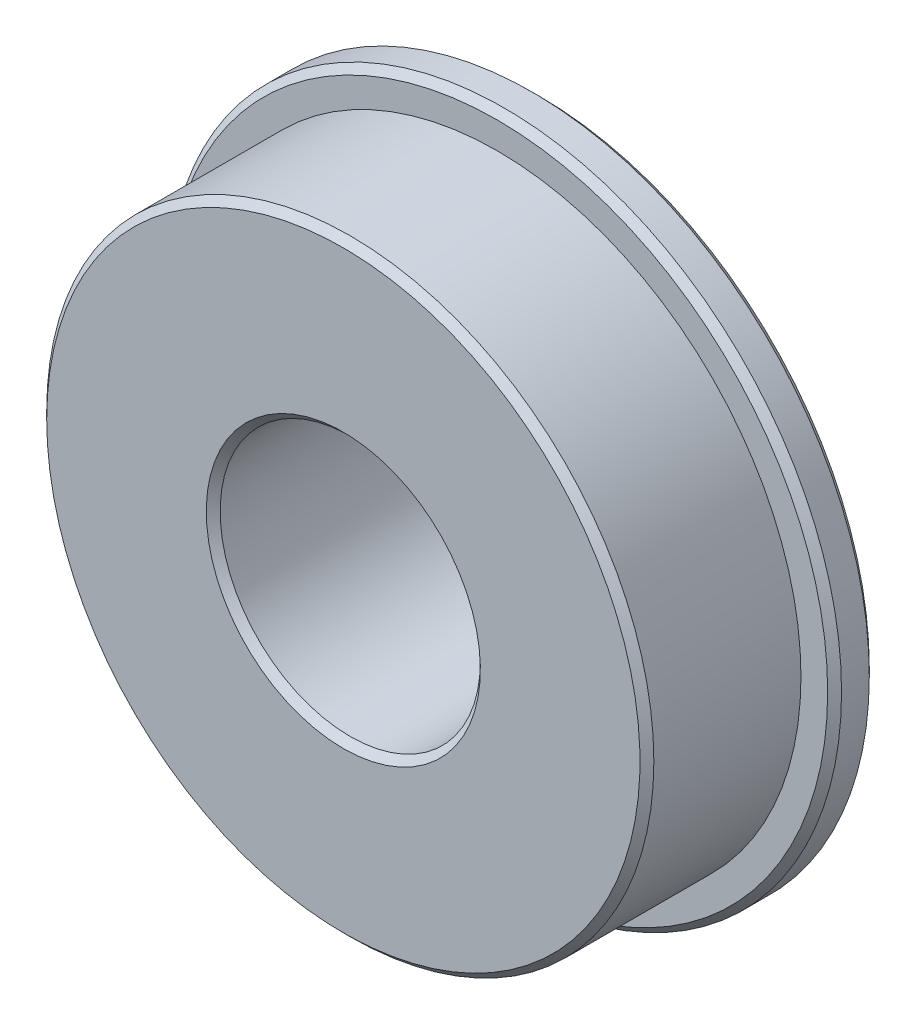
ISO-10303-21;
HEADER;
FILE_DESCRIPTION(('STEP AP214'),'2;1');
FILE_NAME('part.step','',(''),(''),'','','');
FILE_SCHEMA(('AUTOMOTIVE_DESIGN { 1 0 10303 214 1 1 1 1 }'));
ENDSEC;
DATA;
#1=APPLICATION_CONTEXT('core data for automotive mechanical design processes');
#2=APPLICATION_PROTOCOL_DEFINITION('international standard','automotive_design',2000,#1);
#3=PRODUCT_CONTEXT('',#1,'mechanical');
#4=PRODUCT('Part','Part','',(#3));
#5=PRODUCT_RELATED_PRODUCT_CATEGORY('part','',(#4));
#6=PRODUCT_DEFINITION_FORMATION('','',#4);
#7=PRODUCT_DEFINITION_CONTEXT('part definition',#1,'design');
#8=PRODUCT_DEFINITION('design','',#6,#7);
#9=PRODUCT_DEFINITION_SHAPE('','',#8);
#10=(LENGTH_UNIT() NAMED_UNIT(*) SI_UNIT(.MILLI.,.METRE.));
#11=(NAMED_UNIT(*) PLANE_ANGLE_UNIT() SI_UNIT($,.RADIAN.));
#12=(NAMED_UNIT(*) SI_UNIT($,.STERADIAN.) SOLID_ANGLE_UNIT());
#13=UNCERTAINTY_MEASURE_WITH_UNIT(LENGTH_MEASURE(1.E-05),#10,'distance_accuracy_value','');
#14=(GEOMETRIC_REPRESENTATION_CONTEXT(3) GLOBAL_UNCERTAINTY_ASSIGNED_CONTEXT((#13)) GLOBAL_UNIT_ASSIGNED_CONTEXT((#10,
#11,#12)) REPRESENTATION_CONTEXT('',''));
#15=CARTESIAN_POINT('',(0.,0.,0.));
#16=DIRECTION('',(0.,0.,1.));
#17=DIRECTION('',(1.,0.,0.));
#18=AXIS2_PLACEMENT_3D('',#15,#16,#17);
#19=CARTESIAN_POINT('',(-8.86153846153845,6.04195804195806,6.90880000000005));
#20=DIRECTION('',(0.,0.,-1.));
#21=DIRECTION('',(-1.,0.,0.));
#22=AXIS2_PLACEMENT_3D('',#19,#20,#21);
#23=CONICAL_SURFACE('',#22,11.1125,0.785398163397452);
#24=CARTESIAN_POINT('',(-8.86153846153845,6.04195804195806,7.16280000000004));
#25=DIRECTION('',(0.,0.,-1.));
#26=DIRECTION('',(-1.,0.,0.));
#27=AXIS2_PLACEMENT_3D('',#24,#25,#26);
#28=CIRCLE('',#27,10.8585);
#29=CARTESIAN_POINT('',(-19.7200384615385,6.04195804195806,7.16280000000004));
#30=VERTEX_POINT('',#29);
#31=EDGE_CURVE('E25',#30,#30,#28,.T.);
#32=ORIENTED_EDGE('',*,*,#31,.T.);
#33=EDGE_LOOP('',(#32));
#34=FACE_BOUND('',#33,.T.);
#35=CARTESIAN_POINT('',(-8.86153846153845,6.04195804195806,6.90880000000005));
#36=DIRECTION('',(0.,0.,1.));
#37=DIRECTION('',(1.,0.,0.));
#38=AXIS2_PLACEMENT_3D('',#35,#36,#37);
#39=CIRCLE('',#38,11.1125);
#40=CARTESIAN_POINT('',(2.25096153846156,6.04195804195806,6.90880000000005));
#41=VERTEX_POINT('',#40);
#42=EDGE_CURVE('E37',#41,#41,#39,.F.);
#43=ORIENTED_EDGE('',*,*,#42,.F.);
#44=EDGE_LOOP('',(#43));
#45=FACE_BOUND('',#44,.T.);
#46=ADVANCED_FACE('F22',(#34,#45),#23,.T.);
#47=CARTESIAN_POINT('',(-8.86153846153845,6.04195804195806,7.16280000000002));
#48=DIRECTION('',(0.,0.,1.));
#49=DIRECTION('',(1.,0.,0.));
#50=AXIS2_PLACEMENT_3D('',#47,#48,#49);
#51=CYLINDRICAL_SURFACE('',#50,11.1125);
#52=CARTESIAN_POINT('',(-8.86153846153845,6.04195804195806,1.52399999999997));
#53=DIRECTION('',(0.,0.,1.));
#54=DIRECTION('',(1.,0.,0.));
#55=AXIS2_PLACEMENT_3D('',#52,#53,#54);
#56=CIRCLE('',#55,11.1125);
#57=CARTESIAN_POINT('',(2.25096153846156,6.04195804195806,1.52399999999997));
#58=VERTEX_POINT('',#57);
#59=EDGE_CURVE('E46',#58,#58,#56,.T.);
#60=ORIENTED_EDGE('',*,*,#59,.T.);
#61=EDGE_LOOP('',(#60));
#62=FACE_BOUND('',#61,.T.);
#63=ORIENTED_EDGE('',*,*,#42,.T.);
#64=EDGE_LOOP('',(#63));
#65=FACE_BOUND('',#64,.T.);
#66=ADVANCED_FACE('F56',(#62,#65),#51,.T.);
#67=CARTESIAN_POINT('',(-8.86153846153845,6.04195804195806,7.16280000000002));
#68=DIRECTION('',(0.,0.,-1.));
#69=DIRECTION('',(-1.,0.,0.));
#70=AXIS2_PLACEMENT_3D('',#67,#68,#69);
#71=PLANE('',#70);
#72=ORIENTED_EDGE('',*,*,#31,.F.);
#73=EDGE_LOOP('',(#72));
#74=FACE_BOUND('',#73,.T.);
#75=CARTESIAN_POINT('',(-8.86153846153845,6.04195804195806,7.16280000011693));
#76=DIRECTION('',(0.,0.,1.));
#77=DIRECTION('',(0.,-1.,0.));
#78=AXIS2_PLACEMENT_3D('',#75,#76,#77);
#79=CIRCLE('',#78,5.01650000001817);
#80=CARTESIAN_POINT('',(-8.86153846153845,1.0254580419399,7.16280000011693));
#81=VERTEX_POINT('',#80);
#82=EDGE_CURVE('E44',#81,#81,#79,.F.);
#83=ORIENTED_EDGE('',*,*,#82,.T.);
#84=EDGE_LOOP('',(#83));
#85=FACE_BOUND('',#84,.T.);
#86=ADVANCED_FACE('F63',(#74,#85),#71,.F.);
#87=CARTESIAN_POINT('',(-8.86153846153845,6.04195804195806,1.52399999999997));
#88=DIRECTION('',(0.,0.,-1.));
#89=DIRECTION('',(-1.,0.,0.));
#90=AXIS2_PLACEMENT_3D('',#87,#88,#89);
#91=PLANE('',#90);
#92=ORIENTED_EDGE('',*,*,#59,.F.);
#93=EDGE_LOOP('',(#92));
#94=FACE_BOUND('',#93,.T.);
#95=CARTESIAN_POINT('',(-8.86153846153845,6.04195804195806,1.52399999999998));
#96=DIRECTION('',(0.,0.,-1.));
#97=DIRECTION('',(-1.,0.,0.));
#98=AXIS2_PLACEMENT_3D('',#95,#96,#97);
#99=CIRCLE('',#98,12.0904);
#100=CARTESIAN_POINT('',(-20.9519384615385,6.04195804195806,1.52399999999998));
#101=VERTEX_POINT('',#100);
#102=EDGE_CURVE('E40',#101,#101,#99,.T.);
#103=ORIENTED_EDGE('',*,*,#102,.F.);
#104=EDGE_LOOP('',(#103));
#105=FACE_BOUND('',#104,.T.);
#106=ADVANCED_FACE('F95',(#94,#105),#91,.F.);
#107=CARTESIAN_POINT('',(-8.86153846153845,6.04195804195806,7.16280000011693));
#108=DIRECTION('',(0.,0.,1.));
#109=DIRECTION('',(0.,-1.,0.));
#110=AXIS2_PLACEMENT_3D('',#107,#108,#109);
#111=CONICAL_SURFACE('',#110,5.01650000001817,0.785398163397448);
#112=CARTESIAN_POINT('',(-8.86153846153845,6.04195804195806,6.90880000000005));
#113=DIRECTION('',(0.,0.,1.));
#114=DIRECTION('',(1.,0.,0.));
#115=AXIS2_PLACEMENT_3D('',#112,#113,#114);
#116=CIRCLE('',#115,4.7625);
#117=CARTESIAN_POINT('',(-4.09903846153845,6.04195804195806,6.90880000000005));
#118=VERTEX_POINT('',#117);
#119=EDGE_CURVE('E43',#118,#118,#116,.F.);
#120=ORIENTED_EDGE('',*,*,#119,.T.);
#121=EDGE_LOOP('',(#120));
#122=FACE_BOUND('',#121,.T.);
#123=ORIENTED_EDGE('',*,*,#82,.F.);
#124=EDGE_LOOP('',(#123));
#125=FACE_BOUND('',#124,.T.);
#126=ADVANCED_FACE('F91',(#122,#125),#111,.F.);
#127=CARTESIAN_POINT('',(-8.86153846153845,6.04195804195806,1.27));
#128=DIRECTION('',(0.,0.,-1.));
#129=DIRECTION('',(-1.,0.,0.));
#130=AXIS2_PLACEMENT_3D('',#127,#128,#129);
#131=CONICAL_SURFACE('',#130,12.3444,0.78539816339745);
#132=CARTESIAN_POINT('',(-8.86153846153845,6.04195804195806,1.26999999999999));
#133=DIRECTION('',(0.,0.,1.));
#134=DIRECTION('',(1.,0.,0.));
#135=AXIS2_PLACEMENT_3D('',#132,#133,#134);
#136=CIRCLE('',#135,12.3444);
#137=CARTESIAN_POINT('',(3.48286153846156,6.04195804195806,1.26999999999999));
#138=VERTEX_POINT('',#137);
#139=EDGE_CURVE('E181',#138,#138,#136,.F.);
#140=ORIENTED_EDGE('',*,*,#139,.F.);
#141=EDGE_LOOP('',(#140));
#142=FACE_BOUND('',#141,.T.);
#143=ORIENTED_EDGE('',*,*,#102,.T.);
#144=EDGE_LOOP('',(#143));
#145=FACE_BOUND('',#144,.T.);
#146=ADVANCED_FACE('F87',(#142,#145),#131,.T.);
#147=CARTESIAN_POINT('',(-8.86153846153845,6.04195804195806,1.52399999999997));
#148=DIRECTION('',(0.,0.,1.));
#149=DIRECTION('',(1.,0.,0.));
#150=AXIS2_PLACEMENT_3D('',#147,#148,#149);
#151=CYLINDRICAL_SURFACE('',#150,4.7625);
#152=ORIENTED_EDGE('',*,*,#119,.F.);
#153=EDGE_LOOP('',(#152));
#154=FACE_BOUND('',#153,.T.);
#155=CARTESIAN_POINT('',(-8.86153846153845,6.04195804195806,0.253999999983989));
#156=DIRECTION('',(0.,0.,-1.));
#157=DIRECTION('',(-1.,0.,0.));
#158=AXIS2_PLACEMENT_3D('',#155,#156,#157);
#159=CIRCLE('',#158,4.76249999990543);
#160=CARTESIAN_POINT('',(-13.6240384614439,6.04195804195806,0.253999999983989));
#161=VERTEX_POINT('',#160);
#162=EDGE_CURVE('E183',#161,#161,#159,.T.);
#163=ORIENTED_EDGE('',*,*,#162,.T.);
#164=EDGE_LOOP('',(#163));
#165=FACE_BOUND('',#164,.T.);
#166=ADVANCED_FACE('F83',(#154,#165),#151,.F.);
#167=CARTESIAN_POINT('',(-8.86153846153845,6.04195804195806,1.52399999999997));
#168=DIRECTION('',(0.,0.,1.));
#169=DIRECTION('',(1.,0.,0.));
#170=AXIS2_PLACEMENT_3D('',#167,#168,#169);
#171=CYLINDRICAL_SURFACE('',#170,12.3444);
#172=CARTESIAN_POINT('',(-8.86153846153845,6.04195804195806,0.25399999999999));
#173=DIRECTION('',(0.,0.,1.));
#174=DIRECTION('',(1.,0.,0.));
#175=AXIS2_PLACEMENT_3D('',#172,#173,#174);
#176=CIRCLE('',#175,12.3444);
#177=CARTESIAN_POINT('',(3.48286153846154,6.04195804195807,0.25399999999999));
#178=VERTEX_POINT('',#177);
#179=EDGE_CURVE('E34',#178,#178,#176,.F.);
#180=ORIENTED_EDGE('',*,*,#179,.F.);
#181=EDGE_LOOP('',(#180));
#182=FACE_BOUND('',#181,.T.);
#183=ORIENTED_EDGE('',*,*,#139,.T.);
#184=EDGE_LOOP('',(#183));
#185=FACE_BOUND('',#184,.T.);
#186=ADVANCED_FACE('F79',(#182,#185),#171,.T.);
#187=CARTESIAN_POINT('',(-8.86153846153845,6.04195804195806,-5.6843418860808E-11));
#188=DIRECTION('',(0.,0.,-1.));
#189=DIRECTION('',(-1.,0.,0.));
#190=AXIS2_PLACEMENT_3D('',#187,#188,#189);
#191=CONICAL_SURFACE('',#190,5.01650000000311,0.785398163509345);
#192=ORIENTED_EDGE('',*,*,#162,.F.);
#193=EDGE_LOOP('',(#192));
#194=FACE_BOUND('',#193,.T.);
#195=CARTESIAN_POINT('',(-8.86153846153845,6.04195804195806,-6.43721187448625E-11));
#196=DIRECTION('',(0.,0.,-1.));
#197=DIRECTION('',(-1.,0.,0.));
#198=AXIS2_PLACEMENT_3D('',#195,#196,#197);
#199=CIRCLE('',#198,5.01650000001064);
#200=CARTESIAN_POINT('',(-13.8780384615491,6.04195804195806,-6.43721187448625E-11));
#201=VERTEX_POINT('',#200);
#202=EDGE_CURVE('E29',#201,#201,#199,.F.);
#203=ORIENTED_EDGE('',*,*,#202,.F.);
#204=EDGE_LOOP('',(#203));
#205=FACE_BOUND('',#204,.T.);
#206=ADVANCED_FACE('F72',(#194,#205),#191,.F.);
#207=CARTESIAN_POINT('',(-8.86153846153845,6.04195804195806,0.253999999999992));
#208=DIRECTION('',(0.,0.,1.));
#209=DIRECTION('',(1.,0.,0.));
#210=AXIS2_PLACEMENT_3D('',#207,#208,#209);
#211=CONICAL_SURFACE('',#210,12.3444,0.785398163397453);
#212=ORIENTED_EDGE('',*,*,#179,.T.);
#213=EDGE_LOOP('',(#212));
#214=FACE_BOUND('',#213,.T.);
#215=CARTESIAN_POINT('',(-8.86153846153845,6.04195804195806,0.));
#216=DIRECTION('',(0.,0.,1.));
#217=DIRECTION('',(1.,0.,0.));
#218=AXIS2_PLACEMENT_3D('',#215,#216,#217);
#219=CIRCLE('',#218,12.0904);
#220=CARTESIAN_POINT('',(3.22886153846155,6.04195804195806,0.));
#221=VERTEX_POINT('',#220);
#222=EDGE_CURVE('E12',#221,#221,#219,.F.);
#223=ORIENTED_EDGE('',*,*,#222,.F.);
#224=EDGE_LOOP('',(#223));
#225=FACE_BOUND('',#224,.T.);
#226=ADVANCED_FACE('F66',(#214,#225),#211,.T.);
#227=CARTESIAN_POINT('',(-8.86153846153845,6.04195804195806,0.));
#228=DIRECTION('',(0.,0.,-1.));
#229=DIRECTION('',(-1.,0.,0.));
#230=AXIS2_PLACEMENT_3D('',#227,#228,#229);
#231=PLANE('',#230);
#232=ORIENTED_EDGE('',*,*,#222,.T.);
#233=EDGE_LOOP('',(#232));
#234=FACE_BOUND('',#233,.T.);
#235=ORIENTED_EDGE('',*,*,#202,.T.);
#236=EDGE_LOOP('',(#235));
#237=FACE_BOUND('',#236,.T.);
#238=ADVANCED_FACE('F64',(#234,#237),#231,.T.);
#239=CLOSED_SHELL('',(#46,#66,#86,#106,#126,#146,#166,#186,#206,#226,#238));
#240=MANIFOLD_SOLID_BREP('B1',#239);
#241=ADVANCED_BREP_SHAPE_REPRESENTATION('',(#18,#240),#14);
#242=SHAPE_DEFINITION_REPRESENTATION(#9,#241);
ENDSEC;
END-ISO-10303-21;
